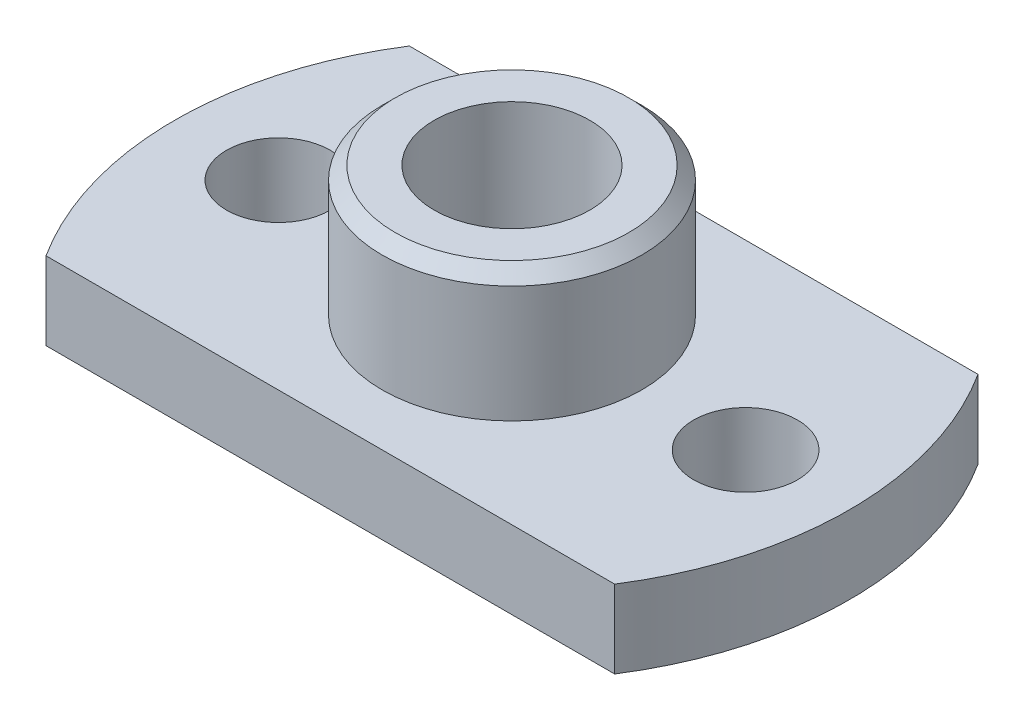
ISO-10303-21;
HEADER;
FILE_DESCRIPTION(('STEP AP214'),'2;1');
FILE_NAME('part.step','',(''),(''),'','','');
FILE_SCHEMA(('AUTOMOTIVE_DESIGN { 1 0 10303 214 1 1 1 1 }'));
ENDSEC;
DATA;
#1=APPLICATION_CONTEXT('core data for automotive mechanical design processes');
#2=APPLICATION_PROTOCOL_DEFINITION('international standard','automotive_design',2000,#1);
#3=PRODUCT_CONTEXT('',#1,'mechanical');
#4=PRODUCT('Part','Part','',(#3));
#5=PRODUCT_RELATED_PRODUCT_CATEGORY('part','',(#4));
#6=PRODUCT_DEFINITION_FORMATION('','',#4);
#7=PRODUCT_DEFINITION_CONTEXT('part definition',#1,'design');
#8=PRODUCT_DEFINITION('design','',#6,#7);
#9=PRODUCT_DEFINITION_SHAPE('','',#8);
#10=(LENGTH_UNIT() NAMED_UNIT(*) SI_UNIT(.MILLI.,.METRE.));
#11=(NAMED_UNIT(*) PLANE_ANGLE_UNIT() SI_UNIT($,.RADIAN.));
#12=(NAMED_UNIT(*) SI_UNIT($,.STERADIAN.) SOLID_ANGLE_UNIT());
#13=UNCERTAINTY_MEASURE_WITH_UNIT(LENGTH_MEASURE(1.E-05),#10,'distance_accuracy_value','');
#14=(GEOMETRIC_REPRESENTATION_CONTEXT(3) GLOBAL_UNCERTAINTY_ASSIGNED_CONTEXT((#13)) GLOBAL_UNIT_ASSIGNED_CONTEXT((#10,
#11,#12)) REPRESENTATION_CONTEXT('',''));
#15=CARTESIAN_POINT('',(0.,0.,0.));
#16=DIRECTION('',(0.,0.,1.));
#17=DIRECTION('',(1.,0.,0.));
#18=AXIS2_PLACEMENT_3D('',#15,#16,#17);
#19=CARTESIAN_POINT('',(0.,0.7,0.));
#20=DIRECTION('',(0.,-1.,0.));
#21=DIRECTION('',(0.,0.,-1.));
#22=AXIS2_PLACEMENT_3D('',#19,#20,#21);
#23=CYLINDRICAL_SURFACE('',#22,1.25);
#24=CARTESIAN_POINT('',(0.,0.7,0.));
#25=DIRECTION('',(0.,-1.,0.));
#26=DIRECTION('',(0.,0.,-1.));
#27=AXIS2_PLACEMENT_3D('',#24,#25,#26);
#28=CIRCLE('',#27,1.25);
#29=CARTESIAN_POINT('',(0.,0.7,-1.25));
#30=VERTEX_POINT('',#29);
#31=EDGE_CURVE('E327',#30,#30,#28,.T.);
#32=ORIENTED_EDGE('',*,*,#31,.T.);
#33=EDGE_LOOP('',(#32));
#34=FACE_BOUND('',#33,.T.);
#35=CARTESIAN_POINT('',(0.,1.5,0.));
#36=DIRECTION('',(0.,1.,0.));
#37=DIRECTION('',(0.,0.,1.));
#38=AXIS2_PLACEMENT_3D('',#35,#36,#37);
#39=CIRCLE('',#38,1.25);
#40=CARTESIAN_POINT('',(0.,1.5,1.25));
#41=VERTEX_POINT('',#40);
#42=EDGE_CURVE('E44',#41,#41,#39,.F.);
#43=ORIENTED_EDGE('',*,*,#42,.F.);
#44=EDGE_LOOP('',(#43));
#45=FACE_BOUND('',#44,.T.);
#46=ADVANCED_FACE('F40',(#34,#45),#23,.F.);
#47=CARTESIAN_POINT('',(0.,3.75,0.));
#48=DIRECTION('',(0.,-1.,0.));
#49=DIRECTION('',(0.,0.,-1.));
#50=AXIS2_PLACEMENT_3D('',#47,#48,#49);
#51=CONICAL_SURFACE('',#50,2.5,0.785398163397447);
#52=CARTESIAN_POINT('',(0.,3.75,0.));
#53=DIRECTION('',(0.,1.,0.));
#54=DIRECTION('',(0.,0.,1.));
#55=AXIS2_PLACEMENT_3D('',#52,#53,#54);
#56=CIRCLE('',#55,2.5);
#57=CARTESIAN_POINT('',(0.,3.75,2.5));
#58=VERTEX_POINT('',#57);
#59=EDGE_CURVE('E50',#58,#58,#56,.F.);
#60=ORIENTED_EDGE('',*,*,#59,.F.);
#61=EDGE_LOOP('',(#60));
#62=FACE_BOUND('',#61,.T.);
#63=CARTESIAN_POINT('',(0.,4.,0.));
#64=DIRECTION('',(0.,1.,0.));
#65=DIRECTION('',(0.,0.,1.));
#66=AXIS2_PLACEMENT_3D('',#63,#64,#65);
#67=CIRCLE('',#66,2.25);
#68=CARTESIAN_POINT('',(0.,4.,2.25));
#69=VERTEX_POINT('',#68);
#70=EDGE_CURVE('E13',#69,#69,#67,.T.);
#71=ORIENTED_EDGE('',*,*,#70,.F.);
#72=EDGE_LOOP('',(#71));
#73=FACE_BOUND('',#72,.T.);
#74=ADVANCED_FACE('F42',(#62,#73),#51,.T.);
#75=CARTESIAN_POINT('',(0.,1.5,3.50000000000002));
#76=DIRECTION('',(0.,0.,-1.));
#77=DIRECTION('',(-1.,0.,0.));
#78=AXIS2_PLACEMENT_3D('',#75,#76,#77);
#79=PLANE('',#78);
#80=DIRECTION('',(1.,0.,0.));
#81=VECTOR('',#80,1.);
#82=CARTESIAN_POINT('',(0.,0.,3.50000000000002));
#83=LINE('',#82,#81);
#84=CARTESIAN_POINT('',(-5.4772255750517,0.,3.50000000000002));
#85=VERTEX_POINT('',#84);
#86=CARTESIAN_POINT('',(5.47722557505162,0.,3.50000000000002));
#87=VERTEX_POINT('',#86);
#88=EDGE_CURVE('E110',#85,#87,#83,.T.);
#89=ORIENTED_EDGE('',*,*,#88,.T.);
#90=DIRECTION('',(0.,-1.,0.));
#91=VECTOR('',#90,1.);
#92=CARTESIAN_POINT('',(5.47722557505162,1.5,3.50000000000002));
#93=LINE('',#92,#91);
#94=CARTESIAN_POINT('',(5.47722557505162,1.5,3.50000000000002));
#95=VERTEX_POINT('',#94);
#96=EDGE_CURVE('E98',#95,#87,#93,.T.);
#97=ORIENTED_EDGE('',*,*,#96,.F.);
#98=DIRECTION('',(1.,0.,0.));
#99=VECTOR('',#98,1.);
#100=CARTESIAN_POINT('',(0.,1.5,3.50000000000002));
#101=LINE('',#100,#99);
#102=CARTESIAN_POINT('',(-5.4772255750517,1.5,3.50000000000002));
#103=VERTEX_POINT('',#102);
#104=EDGE_CURVE('E84',#103,#95,#101,.T.);
#105=ORIENTED_EDGE('',*,*,#104,.F.);
#106=DIRECTION('',(0.,-1.,0.));
#107=VECTOR('',#106,1.);
#108=CARTESIAN_POINT('',(-5.4772255750517,1.5,3.50000000000002));
#109=LINE('',#108,#107);
#110=EDGE_CURVE('E59',#103,#85,#109,.T.);
#111=ORIENTED_EDGE('',*,*,#110,.T.);
#112=EDGE_LOOP('',(#89,#97,#105,#111));
#113=FACE_BOUND('',#112,.T.);
#114=ADVANCED_FACE('F170',(#113),#79,.F.);
#115=CARTESIAN_POINT('',(0.,1.5,0.));
#116=DIRECTION('',(0.,-1.,0.));
#117=DIRECTION('',(0.,0.,-1.));
#118=AXIS2_PLACEMENT_3D('',#115,#116,#117);
#119=CYLINDRICAL_SURFACE('',#118,6.49999999999999);
#120=CARTESIAN_POINT('',(0.,0.,0.));
#121=DIRECTION('',(0.,1.,0.));
#122=DIRECTION('',(0.,0.,1.));
#123=AXIS2_PLACEMENT_3D('',#120,#121,#122);
#124=CIRCLE('',#123,6.49999999999999);
#125=CARTESIAN_POINT('',(5.47722557505162,0.,-3.49999999999998));
#126=VERTEX_POINT('',#125);
#127=EDGE_CURVE('E94',#126,#87,#124,.F.);
#128=ORIENTED_EDGE('',*,*,#127,.F.);
#129=DIRECTION('',(0.,-1.,0.));
#130=VECTOR('',#129,1.);
#131=CARTESIAN_POINT('',(5.47722557505162,1.5,-3.49999999999998));
#132=LINE('',#131,#130);
#133=CARTESIAN_POINT('',(5.47722557505162,1.5,-3.49999999999998));
#134=VERTEX_POINT('',#133);
#135=EDGE_CURVE('E90',#134,#126,#132,.T.);
#136=ORIENTED_EDGE('',*,*,#135,.F.);
#137=CARTESIAN_POINT('',(0.,1.5,0.));
#138=DIRECTION('',(0.,1.,0.));
#139=DIRECTION('',(0.,0.,1.));
#140=AXIS2_PLACEMENT_3D('',#137,#138,#139);
#141=CIRCLE('',#140,6.49999999999999);
#142=EDGE_CURVE('E92',#134,#95,#141,.F.);
#143=ORIENTED_EDGE('',*,*,#142,.T.);
#144=ORIENTED_EDGE('',*,*,#96,.T.);
#145=EDGE_LOOP('',(#128,#136,#143,#144));
#146=FACE_BOUND('',#145,.T.);
#147=ADVANCED_FACE('F91',(#146),#119,.T.);
#148=CARTESIAN_POINT('',(0.,1.5,-3.50000000000002));
#149=DIRECTION('',(0.,0.,-1.));
#150=DIRECTION('',(-1.,0.,0.));
#151=AXIS2_PLACEMENT_3D('',#148,#149,#150);
#152=PLANE('',#151);
#153=DIRECTION('',(1.,0.,0.));
#154=VECTOR('',#153,1.);
#155=CARTESIAN_POINT('',(0.,0.,-3.50000000000002));
#156=LINE('',#155,#154);
#157=CARTESIAN_POINT('',(-5.4772255750517,0.,-3.50000000000006));
#158=VERTEX_POINT('',#157);
#159=EDGE_CURVE('E114',#158,#126,#156,.T.);
#160=ORIENTED_EDGE('',*,*,#159,.F.);
#161=DIRECTION('',(0.,-1.,0.));
#162=VECTOR('',#161,1.);
#163=CARTESIAN_POINT('',(-5.4772255750517,1.5,-3.50000000000006));
#164=LINE('',#163,#162);
#165=CARTESIAN_POINT('',(-5.4772255750517,1.5,-3.50000000000006));
#166=VERTEX_POINT('',#165);
#167=EDGE_CURVE('E73',#166,#158,#164,.T.);
#168=ORIENTED_EDGE('',*,*,#167,.F.);
#169=DIRECTION('',(1.,0.,0.));
#170=VECTOR('',#169,1.);
#171=CARTESIAN_POINT('',(0.,1.5,-3.50000000000002));
#172=LINE('',#171,#170);
#173=EDGE_CURVE('E102',#166,#134,#172,.T.);
#174=ORIENTED_EDGE('',*,*,#173,.T.);
#175=ORIENTED_EDGE('',*,*,#135,.T.);
#176=EDGE_LOOP('',(#160,#168,#174,#175));
#177=FACE_BOUND('',#176,.T.);
#178=ADVANCED_FACE('F104',(#177),#152,.T.);
#179=CARTESIAN_POINT('',(0.,1.5,0.));
#180=DIRECTION('',(0.,-1.,0.));
#181=DIRECTION('',(0.,0.,-1.));
#182=AXIS2_PLACEMENT_3D('',#179,#180,#181);
#183=CYLINDRICAL_SURFACE('',#182,6.50000000000003);
#184=CARTESIAN_POINT('',(0.,0.,0.));
#185=DIRECTION('',(0.,1.,0.));
#186=DIRECTION('',(0.,0.,1.));
#187=AXIS2_PLACEMENT_3D('',#184,#185,#186);
#188=CIRCLE('',#187,6.50000000000003);
#189=EDGE_CURVE('E116',#85,#158,#188,.F.);
#190=ORIENTED_EDGE('',*,*,#189,.F.);
#191=ORIENTED_EDGE('',*,*,#110,.F.);
#192=CARTESIAN_POINT('',(0.,1.5,0.));
#193=DIRECTION('',(0.,1.,0.));
#194=DIRECTION('',(0.,0.,1.));
#195=AXIS2_PLACEMENT_3D('',#192,#193,#194);
#196=CIRCLE('',#195,6.50000000000003);
#197=EDGE_CURVE('E105',#103,#166,#196,.F.);
#198=ORIENTED_EDGE('',*,*,#197,.T.);
#199=ORIENTED_EDGE('',*,*,#167,.T.);
#200=EDGE_LOOP('',(#190,#191,#198,#199));
#201=FACE_BOUND('',#200,.T.);
#202=ADVANCED_FACE('F151',(#201),#183,.T.);
#203=CARTESIAN_POINT('',(0.,1.5,0.));
#204=DIRECTION('',(0.,1.,0.));
#205=DIRECTION('',(0.,0.,1.));
#206=AXIS2_PLACEMENT_3D('',#203,#204,#205);
#207=PLANE('',#206);
#208=CARTESIAN_POINT('',(-4.5,1.5,0.));
#209=DIRECTION('',(0.,1.,0.));
#210=DIRECTION('',(0.,0.,1.));
#211=AXIS2_PLACEMENT_3D('',#208,#209,#210);
#212=CIRCLE('',#211,0.999999999999993);
#213=CARTESIAN_POINT('',(-4.5,1.5,0.999999999999993));
#214=VERTEX_POINT('',#213);
#215=EDGE_CURVE('E133',#214,#214,#212,.T.);
#216=ORIENTED_EDGE('',*,*,#215,.F.);
#217=EDGE_LOOP('',(#216));
#218=FACE_BOUND('',#217,.T.);
#219=CARTESIAN_POINT('',(4.5,1.5,0.));
#220=DIRECTION('',(0.,1.,0.));
#221=DIRECTION('',(0.,0.,1.));
#222=AXIS2_PLACEMENT_3D('',#219,#220,#221);
#223=CIRCLE('',#222,0.999999999999993);
#224=CARTESIAN_POINT('',(4.5,1.5,0.999999999999993));
#225=VERTEX_POINT('',#224);
#226=EDGE_CURVE('E124',#225,#225,#223,.T.);
#227=ORIENTED_EDGE('',*,*,#226,.F.);
#228=EDGE_LOOP('',(#227));
#229=FACE_BOUND('',#228,.T.);
#230=CARTESIAN_POINT('',(0.,1.5,0.));
#231=DIRECTION('',(0.,1.,0.));
#232=DIRECTION('',(0.,0.,1.));
#233=AXIS2_PLACEMENT_3D('',#230,#231,#232);
#234=CIRCLE('',#233,2.5);
#235=CARTESIAN_POINT('',(0.,1.5,2.5));
#236=VERTEX_POINT('',#235);
#237=EDGE_CURVE('E122',#236,#236,#234,.T.);
#238=ORIENTED_EDGE('',*,*,#237,.F.);
#239=EDGE_LOOP('',(#238));
#240=FACE_BOUND('',#239,.T.);
#241=ORIENTED_EDGE('',*,*,#104,.T.);
#242=ORIENTED_EDGE('',*,*,#142,.F.);
#243=ORIENTED_EDGE('',*,*,#173,.F.);
#244=ORIENTED_EDGE('',*,*,#197,.F.);
#245=EDGE_LOOP('',(#241,#242,#243,#244));
#246=FACE_BOUND('',#245,.T.);
#247=ADVANCED_FACE('F101',(#218,#229,#240,#246),#207,.T.);
#248=CARTESIAN_POINT('',(0.,0.,0.));
#249=DIRECTION('',(0.,1.,0.));
#250=DIRECTION('',(0.,0.,1.));
#251=AXIS2_PLACEMENT_3D('',#248,#249,#250);
#252=PLANE('',#251);
#253=CARTESIAN_POINT('',(-4.5,0.,0.));
#254=DIRECTION('',(0.,-1.,0.));
#255=DIRECTION('',(0.,0.,-1.));
#256=AXIS2_PLACEMENT_3D('',#253,#254,#255);
#257=CIRCLE('',#256,0.999999999999987);
#258=CARTESIAN_POINT('',(-4.5,0.,-0.999999999999987));
#259=VERTEX_POINT('',#258);
#260=EDGE_CURVE('E138',#259,#259,#257,.T.);
#261=ORIENTED_EDGE('',*,*,#260,.F.);
#262=EDGE_LOOP('',(#261));
#263=FACE_BOUND('',#262,.T.);
#264=CARTESIAN_POINT('',(4.5,0.,0.));
#265=DIRECTION('',(0.,-1.,0.));
#266=DIRECTION('',(0.,0.,-1.));
#267=AXIS2_PLACEMENT_3D('',#264,#265,#266);
#268=CIRCLE('',#267,0.999999999999987);
#269=CARTESIAN_POINT('',(4.5,0.,-0.999999999999987));
#270=VERTEX_POINT('',#269);
#271=EDGE_CURVE('E127',#270,#270,#268,.T.);
#272=ORIENTED_EDGE('',*,*,#271,.F.);
#273=EDGE_LOOP('',(#272));
#274=FACE_BOUND('',#273,.T.);
#275=CARTESIAN_POINT('',(0.,0.,0.));
#276=DIRECTION('',(0.,1.,0.));
#277=DIRECTION('',(0.,0.,1.));
#278=AXIS2_PLACEMENT_3D('',#275,#276,#277);
#279=CIRCLE('',#278,2.5);
#280=CARTESIAN_POINT('',(0.,0.,2.5));
#281=VERTEX_POINT('',#280);
#282=EDGE_CURVE('E126',#281,#281,#279,.T.);
#283=ORIENTED_EDGE('',*,*,#282,.T.);
#284=EDGE_LOOP('',(#283));
#285=FACE_BOUND('',#284,.T.);
#286=ORIENTED_EDGE('',*,*,#88,.F.);
#287=ORIENTED_EDGE('',*,*,#189,.T.);
#288=ORIENTED_EDGE('',*,*,#159,.T.);
#289=ORIENTED_EDGE('',*,*,#127,.T.);
#290=EDGE_LOOP('',(#286,#287,#288,#289));
#291=FACE_BOUND('',#290,.T.);
#292=ADVANCED_FACE('F150',(#263,#274,#285,#291),#252,.F.);
#293=CARTESIAN_POINT('',(0.,4.,0.));
#294=DIRECTION('',(0.,-1.,0.));
#295=DIRECTION('',(0.,0.,-1.));
#296=AXIS2_PLACEMENT_3D('',#293,#294,#295);
#297=CYLINDRICAL_SURFACE('',#296,2.5);
#298=ORIENTED_EDGE('',*,*,#59,.T.);
#299=EDGE_LOOP('',(#298));
#300=FACE_BOUND('',#299,.T.);
#301=ORIENTED_EDGE('',*,*,#237,.T.);
#302=EDGE_LOOP('',(#301));
#303=FACE_BOUND('',#302,.T.);
#304=ADVANCED_FACE('F147',(#300,#303),#297,.T.);
#305=CARTESIAN_POINT('',(0.,4.,0.));
#306=DIRECTION('',(0.,1.,0.));
#307=DIRECTION('',(0.,0.,1.));
#308=AXIS2_PLACEMENT_3D('',#305,#306,#307);
#309=PLANE('',#308);
#310=CARTESIAN_POINT('',(0.,4.,0.));
#311=DIRECTION('',(0.,1.,0.));
#312=DIRECTION('',(0.,0.,1.));
#313=AXIS2_PLACEMENT_3D('',#310,#311,#312);
#314=CIRCLE('',#313,1.5);
#315=CARTESIAN_POINT('',(0.,4.,1.5));
#316=VERTEX_POINT('',#315);
#317=EDGE_CURVE('E323',#316,#316,#314,.T.);
#318=ORIENTED_EDGE('',*,*,#317,.F.);
#319=EDGE_LOOP('',(#318));
#320=FACE_BOUND('',#319,.T.);
#321=ORIENTED_EDGE('',*,*,#70,.T.);
#322=EDGE_LOOP('',(#321));
#323=FACE_BOUND('',#322,.T.);
#324=ADVANCED_FACE('F193',(#320,#323),#309,.T.);
#325=CARTESIAN_POINT('',(0.,0.7,0.));
#326=DIRECTION('',(0.,-1.,0.));
#327=DIRECTION('',(0.,0.,-1.));
#328=AXIS2_PLACEMENT_3D('',#325,#326,#327);
#329=CYLINDRICAL_SURFACE('',#328,2.5);
#330=CARTESIAN_POINT('',(0.,0.7,0.));
#331=DIRECTION('',(0.,1.,0.));
#332=DIRECTION('',(0.,0.,1.));
#333=AXIS2_PLACEMENT_3D('',#330,#331,#332);
#334=CIRCLE('',#333,2.5);
#335=CARTESIAN_POINT('',(0.,0.7,2.5));
#336=VERTEX_POINT('',#335);
#337=EDGE_CURVE('E112',#336,#336,#334,.T.);
#338=ORIENTED_EDGE('',*,*,#337,.T.);
#339=EDGE_LOOP('',(#338));
#340=FACE_BOUND('',#339,.T.);
#341=ORIENTED_EDGE('',*,*,#282,.F.);
#342=EDGE_LOOP('',(#341));
#343=FACE_BOUND('',#342,.T.);
#344=ADVANCED_FACE('F189',(#340,#343),#329,.F.);
#345=CARTESIAN_POINT('',(0.,0.7,0.));
#346=DIRECTION('',(0.,1.,0.));
#347=DIRECTION('',(0.,0.,1.));
#348=AXIS2_PLACEMENT_3D('',#345,#346,#347);
#349=PLANE('',#348);
#350=ORIENTED_EDGE('',*,*,#31,.F.);
#351=EDGE_LOOP('',(#350));
#352=FACE_BOUND('',#351,.T.);
#353=ORIENTED_EDGE('',*,*,#337,.F.);
#354=EDGE_LOOP('',(#353));
#355=FACE_BOUND('',#354,.T.);
#356=ADVANCED_FACE('F186',(#352,#355),#349,.F.);
#357=CARTESIAN_POINT('',(4.5,0.,0.));
#358=DIRECTION('',(0.,-1.,0.));
#359=DIRECTION('',(0.,0.,-1.));
#360=AXIS2_PLACEMENT_3D('',#357,#358,#359);
#361=CYLINDRICAL_SURFACE('',#360,0.999999999999993);
#362=ORIENTED_EDGE('',*,*,#226,.T.);
#363=EDGE_LOOP('',(#362));
#364=FACE_BOUND('',#363,.T.);
#365=ORIENTED_EDGE('',*,*,#271,.T.);
#366=EDGE_LOOP('',(#365));
#367=FACE_BOUND('',#366,.T.);
#368=ADVANCED_FACE('F182',(#364,#367),#361,.F.);
#369=CARTESIAN_POINT('',(-4.5,0.,0.));
#370=DIRECTION('',(0.,-1.,0.));
#371=DIRECTION('',(0.,0.,-1.));
#372=AXIS2_PLACEMENT_3D('',#369,#370,#371);
#373=CYLINDRICAL_SURFACE('',#372,0.999999999999993);
#374=ORIENTED_EDGE('',*,*,#215,.T.);
#375=EDGE_LOOP('',(#374));
#376=FACE_BOUND('',#375,.T.);
#377=ORIENTED_EDGE('',*,*,#260,.T.);
#378=EDGE_LOOP('',(#377));
#379=FACE_BOUND('',#378,.T.);
#380=ADVANCED_FACE('F178',(#376,#379),#373,.F.);
#381=CARTESIAN_POINT('',(0.,1.5,0.));
#382=DIRECTION('',(0.,1.,0.));
#383=DIRECTION('',(0.,0.,1.));
#384=AXIS2_PLACEMENT_3D('',#381,#382,#383);
#385=PLANE('',#384);
#386=CARTESIAN_POINT('',(0.,1.5,0.));
#387=DIRECTION('',(0.,1.,0.));
#388=DIRECTION('',(0.,0.,1.));
#389=AXIS2_PLACEMENT_3D('',#386,#387,#388);
#390=CIRCLE('',#389,1.5);
#391=CARTESIAN_POINT('',(0.,1.5,1.5));
#392=VERTEX_POINT('',#391);
#393=EDGE_CURVE('E320',#392,#392,#390,.F.);
#394=ORIENTED_EDGE('',*,*,#393,.F.);
#395=EDGE_LOOP('',(#394));
#396=FACE_BOUND('',#395,.T.);
#397=ORIENTED_EDGE('',*,*,#42,.T.);
#398=EDGE_LOOP('',(#397));
#399=FACE_BOUND('',#398,.T.);
#400=ADVANCED_FACE('F181',(#396,#399),#385,.T.);
#401=CARTESIAN_POINT('',(0.,-2.74264068711929,0.));
#402=DIRECTION('',(0.,1.,0.));
#403=DIRECTION('',(0.,0.,1.));
#404=AXIS2_PLACEMENT_3D('',#401,#402,#403);
#405=CYLINDRICAL_SURFACE('',#404,1.5);
#406=ORIENTED_EDGE('',*,*,#393,.T.);
#407=EDGE_LOOP('',(#406));
#408=FACE_BOUND('',#407,.T.);
#409=ORIENTED_EDGE('',*,*,#317,.T.);
#410=EDGE_LOOP('',(#409));
#411=FACE_BOUND('',#410,.T.);
#412=ADVANCED_FACE('F176',(#408,#411),#405,.F.);
#413=CLOSED_SHELL('',(#46,#74,#114,#147,#178,#202,#247,#292,#304,#324,#344,#356,#368,#380,#400,#412));
#414=MANIFOLD_SOLID_BREP('B2',#413);
#415=ADVANCED_BREP_SHAPE_REPRESENTATION('',(#18,#414),#14);
#416=SHAPE_DEFINITION_REPRESENTATION(#9,#415);
ENDSEC;
END-ISO-10303-21;
